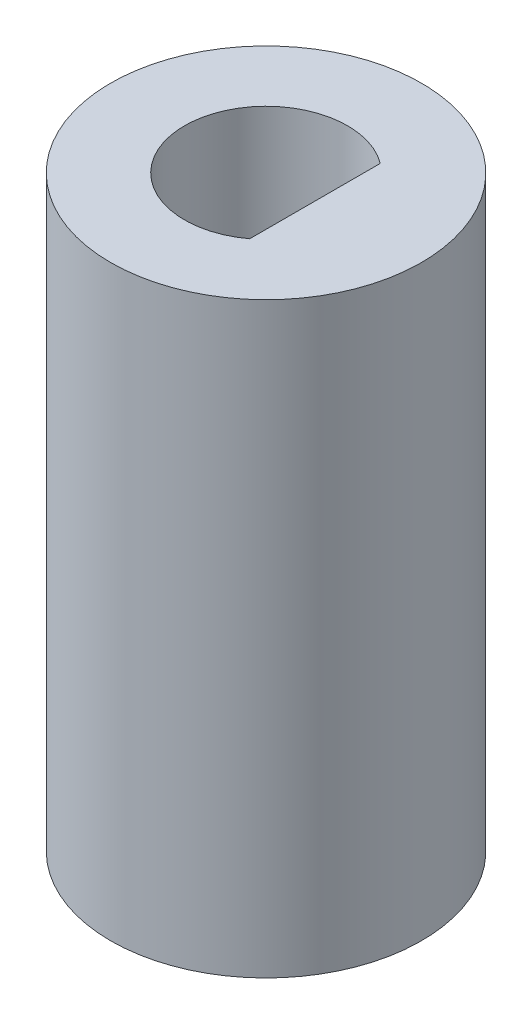
ISO-10303-21;
HEADER;
FILE_DESCRIPTION(('STEP AP214'),'2;1');
FILE_NAME('part.step','',(''),(''),'','','');
FILE_SCHEMA(('AUTOMOTIVE_DESIGN { 1 0 10303 214 1 1 1 1 }'));
ENDSEC;
DATA;
#1=APPLICATION_CONTEXT('core data for automotive mechanical design processes');
#2=APPLICATION_PROTOCOL_DEFINITION('international standard','automotive_design',2000,#1);
#3=PRODUCT_CONTEXT('',#1,'mechanical');
#4=PRODUCT('Part','Part','',(#3));
#5=PRODUCT_RELATED_PRODUCT_CATEGORY('part','',(#4));
#6=PRODUCT_DEFINITION_FORMATION('','',#4);
#7=PRODUCT_DEFINITION_CONTEXT('part definition',#1,'design');
#8=PRODUCT_DEFINITION('design','',#6,#7);
#9=PRODUCT_DEFINITION_SHAPE('','',#8);
#10=(LENGTH_UNIT() NAMED_UNIT(*) SI_UNIT(.MILLI.,.METRE.));
#11=(NAMED_UNIT(*) PLANE_ANGLE_UNIT() SI_UNIT($,.RADIAN.));
#12=(NAMED_UNIT(*) SI_UNIT($,.STERADIAN.) SOLID_ANGLE_UNIT());
#13=UNCERTAINTY_MEASURE_WITH_UNIT(LENGTH_MEASURE(1.E-05),#10,'distance_accuracy_value','');
#14=(GEOMETRIC_REPRESENTATION_CONTEXT(3) GLOBAL_UNCERTAINTY_ASSIGNED_CONTEXT((#13)) GLOBAL_UNIT_ASSIGNED_CONTEXT((#10,
#11,#12)) REPRESENTATION_CONTEXT('',''));
#15=CARTESIAN_POINT('',(0.,0.,0.));
#16=DIRECTION('',(0.,0.,1.));
#17=DIRECTION('',(1.,0.,0.));
#18=AXIS2_PLACEMENT_3D('',#15,#16,#17);
#19=CARTESIAN_POINT('',(-4.67219848687655,-9.,-0.9230208823361));
#20=DIRECTION('',(0.,1.,0.));
#21=DIRECTION('',(0.,0.,1.));
#22=AXIS2_PLACEMENT_3D('',#19,#20,#21);
#23=CYLINDRICAL_SURFACE('',#22,4.7625);
#24=CARTESIAN_POINT('',(-4.67219848687655,-9.,-0.9230208823361));
#25=DIRECTION('',(0.,1.,0.));
#26=DIRECTION('',(0.,0.,1.));
#27=AXIS2_PLACEMENT_3D('',#24,#25,#26);
#28=CIRCLE('',#27,4.7625);
#29=CARTESIAN_POINT('',(-4.67219848687655,-9.,3.8394791176639));
#30=VERTEX_POINT('',#29);
#31=EDGE_CURVE('E11',#30,#30,#28,.T.);
#32=ORIENTED_EDGE('',*,*,#31,.T.);
#33=EDGE_LOOP('',(#32));
#34=FACE_BOUND('',#33,.T.);
#35=CARTESIAN_POINT('',(-4.67219848687655,9.,-0.9230208823361));
#36=DIRECTION('',(0.,1.,0.));
#37=DIRECTION('',(0.,0.,1.));
#38=AXIS2_PLACEMENT_3D('',#35,#36,#37);
#39=CIRCLE('',#38,4.7625);
#40=CARTESIAN_POINT('',(-4.67219848687655,9.,3.8394791176639));
#41=VERTEX_POINT('',#40);
#42=EDGE_CURVE('E51',#41,#41,#39,.T.);
#43=ORIENTED_EDGE('',*,*,#42,.F.);
#44=EDGE_LOOP('',(#43));
#45=FACE_BOUND('',#44,.T.);
#46=ADVANCED_FACE('F43',(#34,#45),#23,.T.);
#47=CARTESIAN_POINT('',(-4.67219848687655,-9.,-0.9230208823361));
#48=DIRECTION('',(0.,1.,0.));
#49=DIRECTION('',(0.,0.,1.));
#50=AXIS2_PLACEMENT_3D('',#47,#48,#49);
#51=PLANE('',#50);
#52=CARTESIAN_POINT('',(-4.67219848687655,-9.,-0.9230208823361));
#53=DIRECTION('',(0.,-1.,0.));
#54=DIRECTION('',(0.,0.,-1.));
#55=AXIS2_PLACEMENT_3D('',#52,#53,#54);
#56=CIRCLE('',#55,1.5875);
#57=CARTESIAN_POINT('',(-4.67219848687655,-9.,-2.5105208823361));
#58=VERTEX_POINT('',#57);
#59=EDGE_CURVE('E90',#58,#58,#56,.T.);
#60=ORIENTED_EDGE('',*,*,#59,.F.);
#61=EDGE_LOOP('',(#60));
#62=FACE_BOUND('',#61,.T.);
#63=ORIENTED_EDGE('',*,*,#31,.F.);
#64=EDGE_LOOP('',(#63));
#65=FACE_BOUND('',#64,.T.);
#66=ADVANCED_FACE('F102',(#62,#65),#51,.F.);
#67=CARTESIAN_POINT('',(-4.67219848687655,9.,-0.9230208823361));
#68=DIRECTION('',(0.,1.,0.));
#69=DIRECTION('',(0.,0.,1.));
#70=AXIS2_PLACEMENT_3D('',#67,#68,#69);
#71=PLANE('',#70);
#72=CARTESIAN_POINT('',(-4.67219848687655,9.,-0.9230208823361));
#73=DIRECTION('',(0.,1.,0.));
#74=DIRECTION('',(0.,0.,1.));
#75=AXIS2_PLACEMENT_3D('',#72,#73,#74);
#76=CIRCLE('',#75,2.5);
#77=CARTESIAN_POINT('',(-3.17219848687655,9.,-2.9230208823361));
#78=VERTEX_POINT('',#77);
#79=CARTESIAN_POINT('',(-3.17219848687655,9.,1.0769791176639));
#80=VERTEX_POINT('',#79);
#81=EDGE_CURVE('E58',#78,#80,#76,.T.);
#82=ORIENTED_EDGE('',*,*,#81,.F.);
#83=DIRECTION('',(0.,0.,-1.));
#84=VECTOR('',#83,1.);
#85=CARTESIAN_POINT('',(-3.17219848687655,9.,1.0769791176639));
#86=LINE('',#85,#84);
#87=EDGE_CURVE('E78',#80,#78,#86,.T.);
#88=ORIENTED_EDGE('',*,*,#87,.F.);
#89=EDGE_LOOP('',(#82,#88));
#90=FACE_BOUND('',#89,.T.);
#91=ORIENTED_EDGE('',*,*,#42,.T.);
#92=EDGE_LOOP('',(#91));
#93=FACE_BOUND('',#92,.T.);
#94=ADVANCED_FACE('F83',(#90,#93),#71,.T.);
#95=CARTESIAN_POINT('',(-4.67219848687655,2.,-0.9230208823361));
#96=DIRECTION('',(0.,1.,0.));
#97=DIRECTION('',(0.,0.,1.));
#98=AXIS2_PLACEMENT_3D('',#95,#96,#97);
#99=CYLINDRICAL_SURFACE('',#98,2.5);
#100=ORIENTED_EDGE('',*,*,#81,.T.);
#101=DIRECTION('',(0.,1.,0.));
#102=VECTOR('',#101,1.);
#103=CARTESIAN_POINT('',(-3.17219848687655,2.,1.0769791176639));
#104=LINE('',#103,#102);
#105=CARTESIAN_POINT('',(-3.17219848687655,2.,1.0769791176639));
#106=VERTEX_POINT('',#105);
#107=EDGE_CURVE('E75',#106,#80,#104,.T.);
#108=ORIENTED_EDGE('',*,*,#107,.F.);
#109=CARTESIAN_POINT('',(-4.67219848687655,2.,-0.9230208823361));
#110=DIRECTION('',(0.,1.,0.));
#111=DIRECTION('',(0.,0.,1.));
#112=AXIS2_PLACEMENT_3D('',#109,#110,#111);
#113=CIRCLE('',#112,2.5);
#114=CARTESIAN_POINT('',(-3.17219848687655,2.,-2.9230208823361));
#115=VERTEX_POINT('',#114);
#116=EDGE_CURVE('E72',#115,#106,#113,.T.);
#117=ORIENTED_EDGE('',*,*,#116,.F.);
#118=DIRECTION('',(0.,1.,0.));
#119=VECTOR('',#118,1.);
#120=CARTESIAN_POINT('',(-3.17219848687655,2.,-2.9230208823361));
#121=LINE('',#120,#119);
#122=EDGE_CURVE('E66',#115,#78,#121,.T.);
#123=ORIENTED_EDGE('',*,*,#122,.T.);
#124=EDGE_LOOP('',(#100,#108,#117,#123));
#125=FACE_BOUND('',#124,.T.);
#126=ADVANCED_FACE('F70',(#125),#99,.F.);
#127=CARTESIAN_POINT('',(-3.17219848687655,2.,1.0769791176639));
#128=DIRECTION('',(1.,0.,0.));
#129=DIRECTION('',(0.,0.,-1.));
#130=AXIS2_PLACEMENT_3D('',#127,#128,#129);
#131=PLANE('',#130);
#132=ORIENTED_EDGE('',*,*,#87,.T.);
#133=ORIENTED_EDGE('',*,*,#122,.F.);
#134=DIRECTION('',(0.,0.,-1.));
#135=VECTOR('',#134,1.);
#136=CARTESIAN_POINT('',(-3.17219848687655,2.,1.0769791176639));
#137=LINE('',#136,#135);
#138=EDGE_CURVE('E93',#106,#115,#137,.T.);
#139=ORIENTED_EDGE('',*,*,#138,.F.);
#140=ORIENTED_EDGE('',*,*,#107,.T.);
#141=EDGE_LOOP('',(#132,#133,#139,#140));
#142=FACE_BOUND('',#141,.T.);
#143=ADVANCED_FACE('F79',(#142),#131,.F.);
#144=CARTESIAN_POINT('',(-4.67219848687655,2.,-0.9230208823361));
#145=DIRECTION('',(0.,1.,0.));
#146=DIRECTION('',(0.,0.,1.));
#147=AXIS2_PLACEMENT_3D('',#144,#145,#146);
#148=PLANE('',#147);
#149=ORIENTED_EDGE('',*,*,#116,.T.);
#150=ORIENTED_EDGE('',*,*,#138,.T.);
#151=EDGE_LOOP('',(#149,#150));
#152=FACE_BOUND('',#151,.T.);
#153=ADVANCED_FACE('F120',(#152),#148,.T.);
#154=CARTESIAN_POINT('',(-4.67219848687655,-2.,-0.9230208823361));
#155=DIRECTION('',(0.,-1.,0.));
#156=DIRECTION('',(0.,0.,-1.));
#157=AXIS2_PLACEMENT_3D('',#154,#155,#156);
#158=CYLINDRICAL_SURFACE('',#157,1.5875);
#159=CARTESIAN_POINT('',(-4.67219848687655,-2.,-0.9230208823361));
#160=DIRECTION('',(0.,-1.,0.));
#161=DIRECTION('',(0.,0.,-1.));
#162=AXIS2_PLACEMENT_3D('',#159,#160,#161);
#163=CIRCLE('',#162,1.5875);
#164=CARTESIAN_POINT('',(-4.67219848687655,-2.,-2.5105208823361));
#165=VERTEX_POINT('',#164);
#166=EDGE_CURVE('E86',#165,#165,#163,.T.);
#167=ORIENTED_EDGE('',*,*,#166,.F.);
#168=EDGE_LOOP('',(#167));
#169=FACE_BOUND('',#168,.T.);
#170=ORIENTED_EDGE('',*,*,#59,.T.);
#171=EDGE_LOOP('',(#170));
#172=FACE_BOUND('',#171,.T.);
#173=ADVANCED_FACE('F123',(#169,#172),#158,.F.);
#174=CARTESIAN_POINT('',(-4.67219848687655,-2.,-0.9230208823361));
#175=DIRECTION('',(0.,-1.,0.));
#176=DIRECTION('',(0.,0.,-1.));
#177=AXIS2_PLACEMENT_3D('',#174,#175,#176);
#178=PLANE('',#177);
#179=ORIENTED_EDGE('',*,*,#166,.T.);
#180=EDGE_LOOP('',(#179));
#181=FACE_BOUND('',#180,.T.);
#182=ADVANCED_FACE('F127',(#181),#178,.T.);
#183=CLOSED_SHELL('',(#46,#66,#94,#126,#143,#153,#173,#182));
#184=MANIFOLD_SOLID_BREP('B2',#183);
#185=ADVANCED_BREP_SHAPE_REPRESENTATION('',(#18,#184),#14);
#186=SHAPE_DEFINITION_REPRESENTATION(#9,#185);
ENDSEC;
END-ISO-10303-21;
